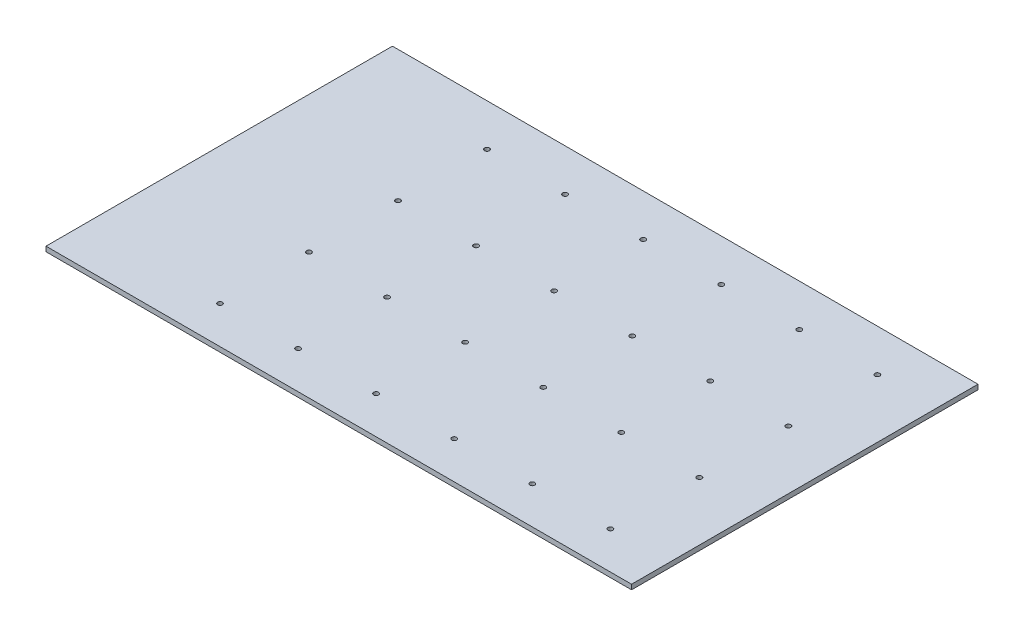
ISO-10303-21;
HEADER;
FILE_DESCRIPTION(('STEP AP214'),'2;1');
FILE_NAME('part.step','',(''),(''),'','','');
FILE_SCHEMA(('AUTOMOTIVE_DESIGN { 1 0 10303 214 1 1 1 1 }'));
ENDSEC;
DATA;
#1=APPLICATION_CONTEXT('core data for automotive mechanical design processes');
#2=APPLICATION_PROTOCOL_DEFINITION('international standard','automotive_design',2000,#1);
#3=PRODUCT_CONTEXT('',#1,'mechanical');
#4=PRODUCT('Part','Part','',(#3));
#5=PRODUCT_RELATED_PRODUCT_CATEGORY('part','',(#4));
#6=PRODUCT_DEFINITION_FORMATION('','',#4);
#7=PRODUCT_DEFINITION_CONTEXT('part definition',#1,'design');
#8=PRODUCT_DEFINITION('design','',#6,#7);
#9=PRODUCT_DEFINITION_SHAPE('','',#8);
#10=(LENGTH_UNIT() NAMED_UNIT(*) SI_UNIT(.MILLI.,.METRE.));
#11=(NAMED_UNIT(*) PLANE_ANGLE_UNIT() SI_UNIT($,.RADIAN.));
#12=(NAMED_UNIT(*) SI_UNIT($,.STERADIAN.) SOLID_ANGLE_UNIT());
#13=UNCERTAINTY_MEASURE_WITH_UNIT(LENGTH_MEASURE(1.E-05),#10,'distance_accuracy_value','');
#14=(GEOMETRIC_REPRESENTATION_CONTEXT(3) GLOBAL_UNCERTAINTY_ASSIGNED_CONTEXT((#13)) GLOBAL_UNIT_ASSIGNED_CONTEXT((#10,
#11,#12)) REPRESENTATION_CONTEXT('',''));
#15=CARTESIAN_POINT('',(0.,0.,0.));
#16=DIRECTION('',(0.,0.,1.));
#17=DIRECTION('',(1.,0.,0.));
#18=AXIS2_PLACEMENT_3D('',#15,#16,#17);
#19=CARTESIAN_POINT('',(0.,6.35,0.));
#20=DIRECTION('',(1.,0.,0.));
#21=DIRECTION('',(0.,0.,-1.));
#22=AXIS2_PLACEMENT_3D('',#19,#20,#21);
#23=PLANE('',#22);
#24=DIRECTION('',(0.,0.,1.));
#25=VECTOR('',#24,1.);
#26=CARTESIAN_POINT('',(0.,0.,0.));
#27=LINE('',#26,#25);
#28=CARTESIAN_POINT('',(0.,0.,-450.85));
#29=VERTEX_POINT('',#28);
#30=CARTESIAN_POINT('',(0.,0.,0.));
#31=VERTEX_POINT('',#30);
#32=EDGE_CURVE('E104',#29,#31,#27,.T.);
#33=ORIENTED_EDGE('',*,*,#32,.T.);
#34=DIRECTION('',(0.,-1.,0.));
#35=VECTOR('',#34,1.);
#36=CARTESIAN_POINT('',(0.,6.35,0.));
#37=LINE('',#36,#35);
#38=CARTESIAN_POINT('',(0.,6.35,0.));
#39=VERTEX_POINT('',#38);
#40=EDGE_CURVE('E11',#39,#31,#37,.T.);
#41=ORIENTED_EDGE('',*,*,#40,.F.);
#42=DIRECTION('',(0.,0.,1.));
#43=VECTOR('',#42,1.);
#44=CARTESIAN_POINT('',(0.,6.35,0.));
#45=LINE('',#44,#43);
#46=CARTESIAN_POINT('',(0.,6.35,-450.85));
#47=VERTEX_POINT('',#46);
#48=EDGE_CURVE('E92',#47,#39,#45,.T.);
#49=ORIENTED_EDGE('',*,*,#48,.F.);
#50=DIRECTION('',(0.,-1.,0.));
#51=VECTOR('',#50,1.);
#52=CARTESIAN_POINT('',(0.,6.35,-450.85));
#53=LINE('',#52,#51);
#54=EDGE_CURVE('E100',#47,#29,#53,.T.);
#55=ORIENTED_EDGE('',*,*,#54,.T.);
#56=EDGE_LOOP('',(#33,#41,#49,#55));
#57=FACE_BOUND('',#56,.T.);
#58=ADVANCED_FACE('F41',(#57),#23,.F.);
#59=CARTESIAN_POINT('',(0.,6.35,0.));
#60=DIRECTION('',(0.,0.,-1.));
#61=DIRECTION('',(-1.,0.,0.));
#62=AXIS2_PLACEMENT_3D('',#59,#60,#61);
#63=PLANE('',#62);
#64=DIRECTION('',(1.,0.,0.));
#65=VECTOR('',#64,1.);
#66=CARTESIAN_POINT('',(0.,0.,0.));
#67=LINE('',#66,#65);
#68=CARTESIAN_POINT('',(762.,0.,0.));
#69=VERTEX_POINT('',#68);
#70=EDGE_CURVE('E96',#31,#69,#67,.T.);
#71=ORIENTED_EDGE('',*,*,#70,.T.);
#72=DIRECTION('',(0.,-1.,0.));
#73=VECTOR('',#72,1.);
#74=CARTESIAN_POINT('',(762.,6.35,0.));
#75=LINE('',#74,#73);
#76=CARTESIAN_POINT('',(762.,6.35,0.));
#77=VERTEX_POINT('',#76);
#78=EDGE_CURVE('E49',#77,#69,#75,.T.);
#79=ORIENTED_EDGE('',*,*,#78,.F.);
#80=DIRECTION('',(1.,0.,0.));
#81=VECTOR('',#80,1.);
#82=CARTESIAN_POINT('',(0.,6.35,0.));
#83=LINE('',#82,#81);
#84=EDGE_CURVE('E87',#39,#77,#83,.T.);
#85=ORIENTED_EDGE('',*,*,#84,.F.);
#86=ORIENTED_EDGE('',*,*,#40,.T.);
#87=EDGE_LOOP('',(#71,#79,#85,#86));
#88=FACE_BOUND('',#87,.T.);
#89=ADVANCED_FACE('F95',(#88),#63,.F.);
#90=CARTESIAN_POINT('',(762.,6.35,0.));
#91=DIRECTION('',(-1.,0.,0.));
#92=DIRECTION('',(0.,0.,1.));
#93=AXIS2_PLACEMENT_3D('',#90,#91,#92);
#94=PLANE('',#93);
#95=DIRECTION('',(0.,0.,-1.));
#96=VECTOR('',#95,1.);
#97=CARTESIAN_POINT('',(762.,0.,0.));
#98=LINE('',#97,#96);
#99=CARTESIAN_POINT('',(762.,0.,-450.85));
#100=VERTEX_POINT('',#99);
#101=EDGE_CURVE('E74',#69,#100,#98,.T.);
#102=ORIENTED_EDGE('',*,*,#101,.T.);
#103=DIRECTION('',(0.,-1.,0.));
#104=VECTOR('',#103,1.);
#105=CARTESIAN_POINT('',(762.,6.35,-450.85));
#106=LINE('',#105,#104);
#107=CARTESIAN_POINT('',(762.,6.35,-450.85));
#108=VERTEX_POINT('',#107);
#109=EDGE_CURVE('E97',#108,#100,#106,.T.);
#110=ORIENTED_EDGE('',*,*,#109,.F.);
#111=DIRECTION('',(0.,0.,-1.));
#112=VECTOR('',#111,1.);
#113=CARTESIAN_POINT('',(762.,6.35,0.));
#114=LINE('',#113,#112);
#115=EDGE_CURVE('E90',#77,#108,#114,.T.);
#116=ORIENTED_EDGE('',*,*,#115,.F.);
#117=ORIENTED_EDGE('',*,*,#78,.T.);
#118=EDGE_LOOP('',(#102,#110,#116,#117));
#119=FACE_BOUND('',#118,.T.);
#120=ADVANCED_FACE('F98',(#119),#94,.F.);
#121=CARTESIAN_POINT('',(0.,6.35,-450.85));
#122=DIRECTION('',(0.,0.,1.));
#123=DIRECTION('',(1.,0.,0.));
#124=AXIS2_PLACEMENT_3D('',#121,#122,#123);
#125=PLANE('',#124);
#126=DIRECTION('',(-1.,0.,0.));
#127=VECTOR('',#126,1.);
#128=CARTESIAN_POINT('',(0.,0.,-450.85));
#129=LINE('',#128,#127);
#130=EDGE_CURVE('E80',#100,#29,#129,.T.);
#131=ORIENTED_EDGE('',*,*,#130,.T.);
#132=ORIENTED_EDGE('',*,*,#54,.F.);
#133=DIRECTION('',(-1.,0.,0.));
#134=VECTOR('',#133,1.);
#135=CARTESIAN_POINT('',(0.,6.35,-450.85));
#136=LINE('',#135,#134);
#137=EDGE_CURVE('E57',#108,#47,#136,.T.);
#138=ORIENTED_EDGE('',*,*,#137,.F.);
#139=ORIENTED_EDGE('',*,*,#109,.T.);
#140=EDGE_LOOP('',(#131,#132,#138,#139));
#141=FACE_BOUND('',#140,.T.);
#142=ADVANCED_FACE('F112',(#141),#125,.F.);
#143=CARTESIAN_POINT('',(0.,6.35,0.));
#144=DIRECTION('',(0.,-1.,0.));
#145=DIRECTION('',(0.,0.,-1.));
#146=AXIS2_PLACEMENT_3D('',#143,#144,#145);
#147=PLANE('',#146);
#148=CARTESIAN_POINT('',(177.8,6.35,-48.6156000000001));
#149=DIRECTION('',(0.,1.,0.));
#150=DIRECTION('',(0.,0.,1.));
#151=AXIS2_PLACEMENT_3D('',#148,#149,#150);
#152=CIRCLE('',#151,3.175);
#153=CARTESIAN_POINT('',(177.8,6.35,-45.4406000000001));
#154=VERTEX_POINT('',#153);
#155=EDGE_CURVE('E187',#154,#154,#152,.T.);
#156=ORIENTED_EDGE('',*,*,#155,.F.);
#157=EDGE_LOOP('',(#156));
#158=FACE_BOUND('',#157,.T.);
#159=CARTESIAN_POINT('',(482.6,6.35,-164.4396));
#160=DIRECTION('',(0.,1.,0.));
#161=DIRECTION('',(0.,0.,1.));
#162=AXIS2_PLACEMENT_3D('',#159,#160,#161);
#163=CIRCLE('',#162,3.17499999999986);
#164=CARTESIAN_POINT('',(482.6,6.35,-161.2646));
#165=VERTEX_POINT('',#164);
#166=EDGE_CURVE('E176',#165,#165,#163,.T.);
#167=ORIENTED_EDGE('',*,*,#166,.F.);
#168=EDGE_LOOP('',(#167));
#169=FACE_BOUND('',#168,.T.);
#170=CARTESIAN_POINT('',(381.,6.35,-164.4396));
#171=DIRECTION('',(0.,1.,0.));
#172=DIRECTION('',(0.,0.,1.));
#173=AXIS2_PLACEMENT_3D('',#170,#171,#172);
#174=CIRCLE('',#173,3.17499999999997);
#175=CARTESIAN_POINT('',(381.,6.35,-161.2646));
#176=VERTEX_POINT('',#175);
#177=EDGE_CURVE('E175',#176,#176,#174,.T.);
#178=ORIENTED_EDGE('',*,*,#177,.F.);
#179=EDGE_LOOP('',(#178));
#180=FACE_BOUND('',#179,.T.);
#181=CARTESIAN_POINT('',(279.4,6.35,-164.4396));
#182=DIRECTION('',(0.,1.,0.));
#183=DIRECTION('',(0.,0.,1.));
#184=AXIS2_PLACEMENT_3D('',#181,#182,#183);
#185=CIRCLE('',#184,3.17499999999997);
#186=CARTESIAN_POINT('',(279.4,6.35,-161.2646));
#187=VERTEX_POINT('',#186);
#188=EDGE_CURVE('E164',#187,#187,#185,.T.);
#189=ORIENTED_EDGE('',*,*,#188,.F.);
#190=EDGE_LOOP('',(#189));
#191=FACE_BOUND('',#190,.T.);
#192=CARTESIAN_POINT('',(279.4,6.35,-48.6156000000001));
#193=DIRECTION('',(0.,1.,0.));
#194=DIRECTION('',(0.,0.,1.));
#195=AXIS2_PLACEMENT_3D('',#192,#193,#194);
#196=CIRCLE('',#195,3.17499999999997);
#197=CARTESIAN_POINT('',(279.4,6.35,-45.4406000000001));
#198=VERTEX_POINT('',#197);
#199=EDGE_CURVE('E188',#198,#198,#196,.T.);
#200=ORIENTED_EDGE('',*,*,#199,.F.);
#201=EDGE_LOOP('',(#200));
#202=FACE_BOUND('',#201,.T.);
#203=CARTESIAN_POINT('',(381.,6.35,-48.6156000000001));
#204=DIRECTION('',(0.,1.,0.));
#205=DIRECTION('',(0.,0.,1.));
#206=AXIS2_PLACEMENT_3D('',#203,#204,#205);
#207=CIRCLE('',#206,3.17499999999997);
#208=CARTESIAN_POINT('',(381.,6.35,-45.4406000000001));
#209=VERTEX_POINT('',#208);
#210=EDGE_CURVE('E212',#209,#209,#207,.T.);
#211=ORIENTED_EDGE('',*,*,#210,.F.);
#212=EDGE_LOOP('',(#211));
#213=FACE_BOUND('',#212,.T.);
#214=CARTESIAN_POINT('',(482.6,6.35,-48.6156000000001));
#215=DIRECTION('',(0.,1.,0.));
#216=DIRECTION('',(0.,0.,1.));
#217=AXIS2_PLACEMENT_3D('',#214,#215,#216);
#218=CIRCLE('',#217,3.17499999999985);
#219=CARTESIAN_POINT('',(482.6,6.35,-45.4406000000002));
#220=VERTEX_POINT('',#219);
#221=EDGE_CURVE('E206',#220,#220,#218,.T.);
#222=ORIENTED_EDGE('',*,*,#221,.F.);
#223=EDGE_LOOP('',(#222));
#224=FACE_BOUND('',#223,.T.);
#225=CARTESIAN_POINT('',(584.2,6.35,-396.0876));
#226=DIRECTION('',(0.,1.,0.));
#227=DIRECTION('',(0.,0.,1.));
#228=AXIS2_PLACEMENT_3D('',#225,#226,#227);
#229=CIRCLE('',#228,3.17499999999985);
#230=CARTESIAN_POINT('',(584.2,6.35,-392.9126));
#231=VERTEX_POINT('',#230);
#232=EDGE_CURVE('E199',#231,#231,#229,.T.);
#233=ORIENTED_EDGE('',*,*,#232,.F.);
#234=EDGE_LOOP('',(#233));
#235=FACE_BOUND('',#234,.T.);
#236=CARTESIAN_POINT('',(177.8,6.35,-280.2636));
#237=DIRECTION('',(0.,1.,0.));
#238=DIRECTION('',(0.,0.,1.));
#239=AXIS2_PLACEMENT_3D('',#236,#237,#238);
#240=CIRCLE('',#239,3.17499999999997);
#241=CARTESIAN_POINT('',(177.8,6.35,-277.0886));
#242=VERTEX_POINT('',#241);
#243=EDGE_CURVE('E139',#242,#242,#240,.T.);
#244=ORIENTED_EDGE('',*,*,#243,.F.);
#245=EDGE_LOOP('',(#244));
#246=FACE_BOUND('',#245,.T.);
#247=CARTESIAN_POINT('',(482.6,6.35,-396.0876));
#248=DIRECTION('',(0.,1.,0.));
#249=DIRECTION('',(0.,0.,1.));
#250=AXIS2_PLACEMENT_3D('',#247,#248,#249);
#251=CIRCLE('',#250,3.17499999999985);
#252=CARTESIAN_POINT('',(482.6,6.35,-392.9126));
#253=VERTEX_POINT('',#252);
#254=EDGE_CURVE('E128',#253,#253,#251,.T.);
#255=ORIENTED_EDGE('',*,*,#254,.F.);
#256=EDGE_LOOP('',(#255));
#257=FACE_BOUND('',#256,.T.);
#258=CARTESIAN_POINT('',(381.,6.35,-396.0876));
#259=DIRECTION('',(0.,1.,0.));
#260=DIRECTION('',(0.,0.,1.));
#261=AXIS2_PLACEMENT_3D('',#258,#259,#260);
#262=CIRCLE('',#261,3.17499999999997);
#263=CARTESIAN_POINT('',(381.,6.35,-392.9126));
#264=VERTEX_POINT('',#263);
#265=EDGE_CURVE('E127',#264,#264,#262,.T.);
#266=ORIENTED_EDGE('',*,*,#265,.F.);
#267=EDGE_LOOP('',(#266));
#268=FACE_BOUND('',#267,.T.);
#269=CARTESIAN_POINT('',(279.4,6.35,-396.0876));
#270=DIRECTION('',(0.,1.,0.));
#271=DIRECTION('',(0.,0.,1.));
#272=AXIS2_PLACEMENT_3D('',#269,#270,#271);
#273=CIRCLE('',#272,3.17499999999997);
#274=CARTESIAN_POINT('',(279.4,6.35,-392.9126));
#275=VERTEX_POINT('',#274);
#276=EDGE_CURVE('E121',#275,#275,#273,.T.);
#277=ORIENTED_EDGE('',*,*,#276,.F.);
#278=EDGE_LOOP('',(#277));
#279=FACE_BOUND('',#278,.T.);
#280=CARTESIAN_POINT('',(177.8,6.35,-164.4396));
#281=DIRECTION('',(0.,1.,0.));
#282=DIRECTION('',(0.,0.,1.));
#283=AXIS2_PLACEMENT_3D('',#280,#281,#282);
#284=CIRCLE('',#283,3.175);
#285=CARTESIAN_POINT('',(177.8,6.35,-161.2646));
#286=VERTEX_POINT('',#285);
#287=EDGE_CURVE('E163',#286,#286,#284,.T.);
#288=ORIENTED_EDGE('',*,*,#287,.F.);
#289=EDGE_LOOP('',(#288));
#290=FACE_BOUND('',#289,.T.);
#291=CARTESIAN_POINT('',(482.6,6.35,-280.2636));
#292=DIRECTION('',(0.,1.,0.));
#293=DIRECTION('',(0.,0.,1.));
#294=AXIS2_PLACEMENT_3D('',#291,#292,#293);
#295=CIRCLE('',#294,3.17499999999985);
#296=CARTESIAN_POINT('',(482.6,6.35,-277.0886));
#297=VERTEX_POINT('',#296);
#298=EDGE_CURVE('E152',#297,#297,#295,.T.);
#299=ORIENTED_EDGE('',*,*,#298,.F.);
#300=EDGE_LOOP('',(#299));
#301=FACE_BOUND('',#300,.T.);
#302=CARTESIAN_POINT('',(381.,6.35,-280.2636));
#303=DIRECTION('',(0.,1.,0.));
#304=DIRECTION('',(0.,0.,1.));
#305=AXIS2_PLACEMENT_3D('',#302,#303,#304);
#306=CIRCLE('',#305,3.17499999999997);
#307=CARTESIAN_POINT('',(381.,6.35,-277.0886));
#308=VERTEX_POINT('',#307);
#309=EDGE_CURVE('E151',#308,#308,#306,.T.);
#310=ORIENTED_EDGE('',*,*,#309,.F.);
#311=EDGE_LOOP('',(#310));
#312=FACE_BOUND('',#311,.T.);
#313=CARTESIAN_POINT('',(279.4,6.35,-280.2636));
#314=DIRECTION('',(0.,1.,0.));
#315=DIRECTION('',(0.,0.,1.));
#316=AXIS2_PLACEMENT_3D('',#313,#314,#315);
#317=CIRCLE('',#316,3.17499999999997);
#318=CARTESIAN_POINT('',(279.4,6.35,-277.0886));
#319=VERTEX_POINT('',#318);
#320=EDGE_CURVE('E140',#319,#319,#317,.T.);
#321=ORIENTED_EDGE('',*,*,#320,.F.);
#322=EDGE_LOOP('',(#321));
#323=FACE_BOUND('',#322,.T.);
#324=CARTESIAN_POINT('',(685.8,6.35,-164.4396));
#325=DIRECTION('',(0.,1.,0.));
#326=DIRECTION('',(0.,0.,1.));
#327=AXIS2_PLACEMENT_3D('',#324,#325,#326);
#328=CIRCLE('',#327,3.17499999999985);
#329=CARTESIAN_POINT('',(685.8,6.35,-161.2646));
#330=VERTEX_POINT('',#329);
#331=EDGE_CURVE('E236',#330,#330,#328,.T.);
#332=ORIENTED_EDGE('',*,*,#331,.F.);
#333=EDGE_LOOP('',(#332));
#334=FACE_BOUND('',#333,.T.);
#335=CARTESIAN_POINT('',(584.2,6.35,-48.6156000000001));
#336=DIRECTION('',(0.,1.,0.));
#337=DIRECTION('',(0.,0.,1.));
#338=AXIS2_PLACEMENT_3D('',#335,#336,#337);
#339=CIRCLE('',#338,3.17499999999985);
#340=CARTESIAN_POINT('',(584.2,6.35,-45.4406000000002));
#341=VERTEX_POINT('',#340);
#342=EDGE_CURVE('E247',#341,#341,#339,.T.);
#343=ORIENTED_EDGE('',*,*,#342,.F.);
#344=EDGE_LOOP('',(#343));
#345=FACE_BOUND('',#344,.T.);
#346=CARTESIAN_POINT('',(685.8,6.35,-48.6156000000001));
#347=DIRECTION('',(0.,1.,0.));
#348=DIRECTION('',(0.,0.,1.));
#349=AXIS2_PLACEMENT_3D('',#346,#347,#348);
#350=CIRCLE('',#349,3.17499999999985);
#351=CARTESIAN_POINT('',(685.8,6.35,-45.4406000000002));
#352=VERTEX_POINT('',#351);
#353=EDGE_CURVE('E248',#352,#352,#350,.T.);
#354=ORIENTED_EDGE('',*,*,#353,.F.);
#355=EDGE_LOOP('',(#354));
#356=FACE_BOUND('',#355,.T.);
#357=CARTESIAN_POINT('',(685.8,6.35,-396.0876));
#358=DIRECTION('',(0.,1.,0.));
#359=DIRECTION('',(0.,0.,1.));
#360=AXIS2_PLACEMENT_3D('',#357,#358,#359);
#361=CIRCLE('',#360,3.17499999999985);
#362=CARTESIAN_POINT('',(685.8,6.35,-392.9126));
#363=VERTEX_POINT('',#362);
#364=EDGE_CURVE('E200',#363,#363,#361,.T.);
#365=ORIENTED_EDGE('',*,*,#364,.F.);
#366=EDGE_LOOP('',(#365));
#367=FACE_BOUND('',#366,.T.);
#368=CARTESIAN_POINT('',(584.2,6.35,-280.2636));
#369=DIRECTION('',(0.,1.,0.));
#370=DIRECTION('',(0.,0.,1.));
#371=AXIS2_PLACEMENT_3D('',#368,#369,#370);
#372=CIRCLE('',#371,3.17499999999985);
#373=CARTESIAN_POINT('',(584.2,6.35,-277.0886));
#374=VERTEX_POINT('',#373);
#375=EDGE_CURVE('E223',#374,#374,#372,.T.);
#376=ORIENTED_EDGE('',*,*,#375,.F.);
#377=EDGE_LOOP('',(#376));
#378=FACE_BOUND('',#377,.T.);
#379=CARTESIAN_POINT('',(685.8,6.35,-280.2636));
#380=DIRECTION('',(0.,1.,0.));
#381=DIRECTION('',(0.,0.,1.));
#382=AXIS2_PLACEMENT_3D('',#379,#380,#381);
#383=CIRCLE('',#382,3.17499999999985);
#384=CARTESIAN_POINT('',(685.8,6.35,-277.0886));
#385=VERTEX_POINT('',#384);
#386=EDGE_CURVE('E224',#385,#385,#383,.T.);
#387=ORIENTED_EDGE('',*,*,#386,.F.);
#388=EDGE_LOOP('',(#387));
#389=FACE_BOUND('',#388,.T.);
#390=CARTESIAN_POINT('',(584.2,6.35,-164.4396));
#391=DIRECTION('',(0.,1.,0.));
#392=DIRECTION('',(0.,0.,1.));
#393=AXIS2_PLACEMENT_3D('',#390,#391,#392);
#394=CIRCLE('',#393,3.17499999999985);
#395=CARTESIAN_POINT('',(584.2,6.35,-161.2646));
#396=VERTEX_POINT('',#395);
#397=EDGE_CURVE('E235',#396,#396,#394,.T.);
#398=ORIENTED_EDGE('',*,*,#397,.F.);
#399=EDGE_LOOP('',(#398));
#400=FACE_BOUND('',#399,.T.);
#401=CARTESIAN_POINT('',(177.8,6.35,-396.0876));
#402=DIRECTION('',(0.,1.,0.));
#403=DIRECTION('',(0.,0.,1.));
#404=AXIS2_PLACEMENT_3D('',#401,#402,#403);
#405=CIRCLE('',#404,3.175);
#406=CARTESIAN_POINT('',(177.8,6.35,-392.9126));
#407=VERTEX_POINT('',#406);
#408=EDGE_CURVE('E118',#407,#407,#405,.T.);
#409=ORIENTED_EDGE('',*,*,#408,.F.);
#410=EDGE_LOOP('',(#409));
#411=FACE_BOUND('',#410,.T.);
#412=ORIENTED_EDGE('',*,*,#48,.T.);
#413=ORIENTED_EDGE('',*,*,#84,.T.);
#414=ORIENTED_EDGE('',*,*,#115,.T.);
#415=ORIENTED_EDGE('',*,*,#137,.T.);
#416=EDGE_LOOP('',(#412,#413,#414,#415));
#417=FACE_BOUND('',#416,.T.);
#418=ADVANCED_FACE('F88',(#158,#169,#180,#191,#202,#213,#224,#235,#246,#257,#268,#279,#290,#301,
#312,#323,#334,#345,#356,#367,#378,#389,#400,#411,#417),#147,.F.);
#419=CARTESIAN_POINT('',(0.,0.,0.));
#420=DIRECTION('',(0.,-1.,0.));
#421=DIRECTION('',(0.,0.,-1.));
#422=AXIS2_PLACEMENT_3D('',#419,#420,#421);
#423=PLANE('',#422);
#424=CARTESIAN_POINT('',(177.8,0.,-48.6156000000001));
#425=DIRECTION('',(0.,1.,0.));
#426=DIRECTION('',(0.,0.,1.));
#427=AXIS2_PLACEMENT_3D('',#424,#425,#426);
#428=CIRCLE('',#427,3.175);
#429=CARTESIAN_POINT('',(177.8,0.,-45.4406000000001));
#430=VERTEX_POINT('',#429);
#431=EDGE_CURVE('E184',#430,#430,#428,.T.);
#432=ORIENTED_EDGE('',*,*,#431,.T.);
#433=EDGE_LOOP('',(#432));
#434=FACE_BOUND('',#433,.T.);
#435=CARTESIAN_POINT('',(482.6,0.,-164.4396));
#436=DIRECTION('',(0.,1.,0.));
#437=DIRECTION('',(0.,0.,1.));
#438=AXIS2_PLACEMENT_3D('',#435,#436,#437);
#439=CIRCLE('',#438,3.17499999999986);
#440=CARTESIAN_POINT('',(482.6,0.,-161.2646));
#441=VERTEX_POINT('',#440);
#442=EDGE_CURVE('E191',#441,#441,#439,.T.);
#443=ORIENTED_EDGE('',*,*,#442,.T.);
#444=EDGE_LOOP('',(#443));
#445=FACE_BOUND('',#444,.T.);
#446=CARTESIAN_POINT('',(381.,0.,-164.4396));
#447=DIRECTION('',(0.,1.,0.));
#448=DIRECTION('',(0.,0.,1.));
#449=AXIS2_PLACEMENT_3D('',#446,#447,#448);
#450=CIRCLE('',#449,3.17499999999997);
#451=CARTESIAN_POINT('',(381.,0.,-161.2646));
#452=VERTEX_POINT('',#451);
#453=EDGE_CURVE('E172',#452,#452,#450,.T.);
#454=ORIENTED_EDGE('',*,*,#453,.T.);
#455=EDGE_LOOP('',(#454));
#456=FACE_BOUND('',#455,.T.);
#457=CARTESIAN_POINT('',(279.4,0.,-164.4396));
#458=DIRECTION('',(0.,1.,0.));
#459=DIRECTION('',(0.,0.,1.));
#460=AXIS2_PLACEMENT_3D('',#457,#458,#459);
#461=CIRCLE('',#460,3.17499999999997);
#462=CARTESIAN_POINT('',(279.4,0.,-161.2646));
#463=VERTEX_POINT('',#462);
#464=EDGE_CURVE('E179',#463,#463,#461,.T.);
#465=ORIENTED_EDGE('',*,*,#464,.T.);
#466=EDGE_LOOP('',(#465));
#467=FACE_BOUND('',#466,.T.);
#468=CARTESIAN_POINT('',(279.4,0.,-48.6156000000001));
#469=DIRECTION('',(0.,1.,0.));
#470=DIRECTION('',(0.,0.,1.));
#471=AXIS2_PLACEMENT_3D('',#468,#469,#470);
#472=CIRCLE('',#471,3.17499999999997);
#473=CARTESIAN_POINT('',(279.4,0.,-45.4406000000001));
#474=VERTEX_POINT('',#473);
#475=EDGE_CURVE('E215',#474,#474,#472,.T.);
#476=ORIENTED_EDGE('',*,*,#475,.T.);
#477=EDGE_LOOP('',(#476));
#478=FACE_BOUND('',#477,.T.);
#479=CARTESIAN_POINT('',(381.,0.,-48.6156000000001));
#480=DIRECTION('',(0.,1.,0.));
#481=DIRECTION('',(0.,0.,1.));
#482=AXIS2_PLACEMENT_3D('',#479,#480,#481);
#483=CIRCLE('',#482,3.17499999999997);
#484=CARTESIAN_POINT('',(381.,0.,-45.4406000000001));
#485=VERTEX_POINT('',#484);
#486=EDGE_CURVE('E209',#485,#485,#483,.T.);
#487=ORIENTED_EDGE('',*,*,#486,.T.);
#488=EDGE_LOOP('',(#487));
#489=FACE_BOUND('',#488,.T.);
#490=CARTESIAN_POINT('',(482.6,0.,-48.6156000000001));
#491=DIRECTION('',(0.,1.,0.));
#492=DIRECTION('',(0.,0.,1.));
#493=AXIS2_PLACEMENT_3D('',#490,#491,#492);
#494=CIRCLE('',#493,3.17499999999985);
#495=CARTESIAN_POINT('',(482.6,0.,-45.4406000000002));
#496=VERTEX_POINT('',#495);
#497=EDGE_CURVE('E203',#496,#496,#494,.T.);
#498=ORIENTED_EDGE('',*,*,#497,.T.);
#499=EDGE_LOOP('',(#498));
#500=FACE_BOUND('',#499,.T.);
#501=CARTESIAN_POINT('',(584.2,0.,-396.0876));
#502=DIRECTION('',(0.,1.,0.));
#503=DIRECTION('',(0.,0.,1.));
#504=AXIS2_PLACEMENT_3D('',#501,#502,#503);
#505=CIRCLE('',#504,3.17499999999985);
#506=CARTESIAN_POINT('',(584.2,0.,-392.9126));
#507=VERTEX_POINT('',#506);
#508=EDGE_CURVE('E196',#507,#507,#505,.T.);
#509=ORIENTED_EDGE('',*,*,#508,.T.);
#510=EDGE_LOOP('',(#509));
#511=FACE_BOUND('',#510,.T.);
#512=CARTESIAN_POINT('',(177.8,0.,-280.2636));
#513=DIRECTION('',(0.,1.,0.));
#514=DIRECTION('',(0.,0.,1.));
#515=AXIS2_PLACEMENT_3D('',#512,#513,#514);
#516=CIRCLE('',#515,3.17499999999997);
#517=CARTESIAN_POINT('',(177.8,0.,-277.0886));
#518=VERTEX_POINT('',#517);
#519=EDGE_CURVE('E136',#518,#518,#516,.T.);
#520=ORIENTED_EDGE('',*,*,#519,.T.);
#521=EDGE_LOOP('',(#520));
#522=FACE_BOUND('',#521,.T.);
#523=CARTESIAN_POINT('',(482.6,0.,-396.0876));
#524=DIRECTION('',(0.,1.,0.));
#525=DIRECTION('',(0.,0.,1.));
#526=AXIS2_PLACEMENT_3D('',#523,#524,#525);
#527=CIRCLE('',#526,3.17499999999985);
#528=CARTESIAN_POINT('',(482.6,0.,-392.9126));
#529=VERTEX_POINT('',#528);
#530=EDGE_CURVE('E143',#529,#529,#527,.T.);
#531=ORIENTED_EDGE('',*,*,#530,.T.);
#532=EDGE_LOOP('',(#531));
#533=FACE_BOUND('',#532,.T.);
#534=CARTESIAN_POINT('',(381.,0.,-396.0876));
#535=DIRECTION('',(0.,1.,0.));
#536=DIRECTION('',(0.,0.,1.));
#537=AXIS2_PLACEMENT_3D('',#534,#535,#536);
#538=CIRCLE('',#537,3.17499999999997);
#539=CARTESIAN_POINT('',(381.,0.,-392.9126));
#540=VERTEX_POINT('',#539);
#541=EDGE_CURVE('E124',#540,#540,#538,.T.);
#542=ORIENTED_EDGE('',*,*,#541,.T.);
#543=EDGE_LOOP('',(#542));
#544=FACE_BOUND('',#543,.T.);
#545=CARTESIAN_POINT('',(279.4,0.,-396.0876));
#546=DIRECTION('',(0.,1.,0.));
#547=DIRECTION('',(0.,0.,1.));
#548=AXIS2_PLACEMENT_3D('',#545,#546,#547);
#549=CIRCLE('',#548,3.17499999999997);
#550=CARTESIAN_POINT('',(279.4,0.,-392.9126));
#551=VERTEX_POINT('',#550);
#552=EDGE_CURVE('E131',#551,#551,#549,.T.);
#553=ORIENTED_EDGE('',*,*,#552,.T.);
#554=EDGE_LOOP('',(#553));
#555=FACE_BOUND('',#554,.T.);
#556=CARTESIAN_POINT('',(177.8,0.,-164.4396));
#557=DIRECTION('',(0.,1.,0.));
#558=DIRECTION('',(0.,0.,1.));
#559=AXIS2_PLACEMENT_3D('',#556,#557,#558);
#560=CIRCLE('',#559,3.175);
#561=CARTESIAN_POINT('',(177.8,0.,-161.2646));
#562=VERTEX_POINT('',#561);
#563=EDGE_CURVE('E160',#562,#562,#560,.T.);
#564=ORIENTED_EDGE('',*,*,#563,.T.);
#565=EDGE_LOOP('',(#564));
#566=FACE_BOUND('',#565,.T.);
#567=CARTESIAN_POINT('',(482.6,0.,-280.2636));
#568=DIRECTION('',(0.,1.,0.));
#569=DIRECTION('',(0.,0.,1.));
#570=AXIS2_PLACEMENT_3D('',#567,#568,#569);
#571=CIRCLE('',#570,3.17499999999985);
#572=CARTESIAN_POINT('',(482.6,0.,-277.0886));
#573=VERTEX_POINT('',#572);
#574=EDGE_CURVE('E167',#573,#573,#571,.T.);
#575=ORIENTED_EDGE('',*,*,#574,.T.);
#576=EDGE_LOOP('',(#575));
#577=FACE_BOUND('',#576,.T.);
#578=CARTESIAN_POINT('',(381.,0.,-280.2636));
#579=DIRECTION('',(0.,1.,0.));
#580=DIRECTION('',(0.,0.,1.));
#581=AXIS2_PLACEMENT_3D('',#578,#579,#580);
#582=CIRCLE('',#581,3.17499999999997);
#583=CARTESIAN_POINT('',(381.,0.,-277.0886));
#584=VERTEX_POINT('',#583);
#585=EDGE_CURVE('E148',#584,#584,#582,.T.);
#586=ORIENTED_EDGE('',*,*,#585,.T.);
#587=EDGE_LOOP('',(#586));
#588=FACE_BOUND('',#587,.T.);
#589=CARTESIAN_POINT('',(279.4,0.,-280.2636));
#590=DIRECTION('',(0.,1.,0.));
#591=DIRECTION('',(0.,0.,1.));
#592=AXIS2_PLACEMENT_3D('',#589,#590,#591);
#593=CIRCLE('',#592,3.17499999999997);
#594=CARTESIAN_POINT('',(279.4,0.,-277.0886));
#595=VERTEX_POINT('',#594);
#596=EDGE_CURVE('E155',#595,#595,#593,.T.);
#597=ORIENTED_EDGE('',*,*,#596,.T.);
#598=EDGE_LOOP('',(#597));
#599=FACE_BOUND('',#598,.T.);
#600=CARTESIAN_POINT('',(685.8,0.,-164.4396));
#601=DIRECTION('',(0.,1.,0.));
#602=DIRECTION('',(0.,0.,1.));
#603=AXIS2_PLACEMENT_3D('',#600,#601,#602);
#604=CIRCLE('',#603,3.17499999999985);
#605=CARTESIAN_POINT('',(685.8,0.,-161.2646));
#606=VERTEX_POINT('',#605);
#607=EDGE_CURVE('E251',#606,#606,#604,.T.);
#608=ORIENTED_EDGE('',*,*,#607,.T.);
#609=EDGE_LOOP('',(#608));
#610=FACE_BOUND('',#609,.T.);
#611=CARTESIAN_POINT('',(584.2,0.,-48.6156000000001));
#612=DIRECTION('',(0.,1.,0.));
#613=DIRECTION('',(0.,0.,1.));
#614=AXIS2_PLACEMENT_3D('',#611,#612,#613);
#615=CIRCLE('',#614,3.17499999999985);
#616=CARTESIAN_POINT('',(584.2,0.,-45.4406000000002));
#617=VERTEX_POINT('',#616);
#618=EDGE_CURVE('E244',#617,#617,#615,.T.);
#619=ORIENTED_EDGE('',*,*,#618,.T.);
#620=EDGE_LOOP('',(#619));
#621=FACE_BOUND('',#620,.T.);
#622=CARTESIAN_POINT('',(685.8,0.,-48.6156000000001));
#623=DIRECTION('',(0.,1.,0.));
#624=DIRECTION('',(0.,0.,1.));
#625=AXIS2_PLACEMENT_3D('',#622,#623,#624);
#626=CIRCLE('',#625,3.17499999999985);
#627=CARTESIAN_POINT('',(685.8,0.,-45.4406000000002));
#628=VERTEX_POINT('',#627);
#629=EDGE_CURVE('E256',#628,#628,#626,.T.);
#630=ORIENTED_EDGE('',*,*,#629,.T.);
#631=EDGE_LOOP('',(#630));
#632=FACE_BOUND('',#631,.T.);
#633=CARTESIAN_POINT('',(685.8,0.,-396.0876));
#634=DIRECTION('',(0.,1.,0.));
#635=DIRECTION('',(0.,0.,1.));
#636=AXIS2_PLACEMENT_3D('',#633,#634,#635);
#637=CIRCLE('',#636,3.17499999999985);
#638=CARTESIAN_POINT('',(685.8,0.,-392.9126));
#639=VERTEX_POINT('',#638);
#640=EDGE_CURVE('E227',#639,#639,#637,.T.);
#641=ORIENTED_EDGE('',*,*,#640,.T.);
#642=EDGE_LOOP('',(#641));
#643=FACE_BOUND('',#642,.T.);
#644=CARTESIAN_POINT('',(584.2,0.,-280.2636));
#645=DIRECTION('',(0.,1.,0.));
#646=DIRECTION('',(0.,0.,1.));
#647=AXIS2_PLACEMENT_3D('',#644,#645,#646);
#648=CIRCLE('',#647,3.17499999999985);
#649=CARTESIAN_POINT('',(584.2,0.,-277.0886));
#650=VERTEX_POINT('',#649);
#651=EDGE_CURVE('E220',#650,#650,#648,.T.);
#652=ORIENTED_EDGE('',*,*,#651,.T.);
#653=EDGE_LOOP('',(#652));
#654=FACE_BOUND('',#653,.T.);
#655=CARTESIAN_POINT('',(685.8,0.,-280.2636));
#656=DIRECTION('',(0.,1.,0.));
#657=DIRECTION('',(0.,0.,1.));
#658=AXIS2_PLACEMENT_3D('',#655,#656,#657);
#659=CIRCLE('',#658,3.17499999999985);
#660=CARTESIAN_POINT('',(685.8,0.,-277.0886));
#661=VERTEX_POINT('',#660);
#662=EDGE_CURVE('E239',#661,#661,#659,.T.);
#663=ORIENTED_EDGE('',*,*,#662,.T.);
#664=EDGE_LOOP('',(#663));
#665=FACE_BOUND('',#664,.T.);
#666=CARTESIAN_POINT('',(584.2,0.,-164.4396));
#667=DIRECTION('',(0.,1.,0.));
#668=DIRECTION('',(0.,0.,1.));
#669=AXIS2_PLACEMENT_3D('',#666,#667,#668);
#670=CIRCLE('',#669,3.17499999999985);
#671=CARTESIAN_POINT('',(584.2,0.,-161.2646));
#672=VERTEX_POINT('',#671);
#673=EDGE_CURVE('E232',#672,#672,#670,.T.);
#674=ORIENTED_EDGE('',*,*,#673,.T.);
#675=EDGE_LOOP('',(#674));
#676=FACE_BOUND('',#675,.T.);
#677=CARTESIAN_POINT('',(177.8,0.,-396.0876));
#678=DIRECTION('',(0.,1.,0.));
#679=DIRECTION('',(0.,0.,1.));
#680=AXIS2_PLACEMENT_3D('',#677,#678,#679);
#681=CIRCLE('',#680,3.175);
#682=CARTESIAN_POINT('',(177.8,0.,-392.9126));
#683=VERTEX_POINT('',#682);
#684=EDGE_CURVE('E107',#683,#683,#681,.T.);
#685=ORIENTED_EDGE('',*,*,#684,.T.);
#686=EDGE_LOOP('',(#685));
#687=FACE_BOUND('',#686,.T.);
#688=ORIENTED_EDGE('',*,*,#32,.F.);
#689=ORIENTED_EDGE('',*,*,#130,.F.);
#690=ORIENTED_EDGE('',*,*,#101,.F.);
#691=ORIENTED_EDGE('',*,*,#70,.F.);
#692=EDGE_LOOP('',(#688,#689,#690,#691));
#693=FACE_BOUND('',#692,.T.);
#694=ADVANCED_FACE('F115',(#434,#445,#456,#467,#478,#489,#500,#511,#522,#533,#544,#555,#566,
#577,#588,#599,#610,#621,#632,#643,#654,#665,#676,#687,#693),#423,.T.);
#695=CARTESIAN_POINT('',(177.8,0.,-396.0876));
#696=DIRECTION('',(0.,1.,0.));
#697=DIRECTION('',(0.,0.,1.));
#698=AXIS2_PLACEMENT_3D('',#695,#696,#697);
#699=CYLINDRICAL_SURFACE('',#698,3.175);
#700=ORIENTED_EDGE('',*,*,#684,.F.);
#701=EDGE_LOOP('',(#700));
#702=FACE_BOUND('',#701,.T.);
#703=ORIENTED_EDGE('',*,*,#408,.T.);
#704=EDGE_LOOP('',(#703));
#705=FACE_BOUND('',#704,.T.);
#706=ADVANCED_FACE('F278',(#702,#705),#699,.F.);
#707=CARTESIAN_POINT('',(584.2,0.,-164.4396));
#708=DIRECTION('',(0.,1.,0.));
#709=DIRECTION('',(0.,0.,1.));
#710=AXIS2_PLACEMENT_3D('',#707,#708,#709);
#711=CYLINDRICAL_SURFACE('',#710,3.17499999999985);
#712=ORIENTED_EDGE('',*,*,#673,.F.);
#713=EDGE_LOOP('',(#712));
#714=FACE_BOUND('',#713,.T.);
#715=ORIENTED_EDGE('',*,*,#397,.T.);
#716=EDGE_LOOP('',(#715));
#717=FACE_BOUND('',#716,.T.);
#718=ADVANCED_FACE('F280',(#714,#717),#711,.F.);
#719=CARTESIAN_POINT('',(685.8,0.,-280.2636));
#720=DIRECTION('',(0.,1.,0.));
#721=DIRECTION('',(0.,0.,1.));
#722=AXIS2_PLACEMENT_3D('',#719,#720,#721);
#723=CYLINDRICAL_SURFACE('',#722,3.17499999999985);
#724=ORIENTED_EDGE('',*,*,#662,.F.);
#725=EDGE_LOOP('',(#724));
#726=FACE_BOUND('',#725,.T.);
#727=ORIENTED_EDGE('',*,*,#386,.T.);
#728=EDGE_LOOP('',(#727));
#729=FACE_BOUND('',#728,.T.);
#730=ADVANCED_FACE('F287',(#726,#729),#723,.F.);
#731=CARTESIAN_POINT('',(584.2,0.,-280.2636));
#732=DIRECTION('',(0.,1.,0.));
#733=DIRECTION('',(0.,0.,1.));
#734=AXIS2_PLACEMENT_3D('',#731,#732,#733);
#735=CYLINDRICAL_SURFACE('',#734,3.17499999999985);
#736=ORIENTED_EDGE('',*,*,#651,.F.);
#737=EDGE_LOOP('',(#736));
#738=FACE_BOUND('',#737,.T.);
#739=ORIENTED_EDGE('',*,*,#375,.T.);
#740=EDGE_LOOP('',(#739));
#741=FACE_BOUND('',#740,.T.);
#742=ADVANCED_FACE('F335',(#738,#741),#735,.F.);
#743=CARTESIAN_POINT('',(685.8,0.,-396.0876));
#744=DIRECTION('',(0.,1.,0.));
#745=DIRECTION('',(0.,0.,1.));
#746=AXIS2_PLACEMENT_3D('',#743,#744,#745);
#747=CYLINDRICAL_SURFACE('',#746,3.17499999999985);
#748=ORIENTED_EDGE('',*,*,#640,.F.);
#749=EDGE_LOOP('',(#748));
#750=FACE_BOUND('',#749,.T.);
#751=ORIENTED_EDGE('',*,*,#364,.T.);
#752=EDGE_LOOP('',(#751));
#753=FACE_BOUND('',#752,.T.);
#754=ADVANCED_FACE('F345',(#750,#753),#747,.F.);
#755=CARTESIAN_POINT('',(685.8,0.,-48.6156000000001));
#756=DIRECTION('',(0.,1.,0.));
#757=DIRECTION('',(0.,0.,1.));
#758=AXIS2_PLACEMENT_3D('',#755,#756,#757);
#759=CYLINDRICAL_SURFACE('',#758,3.17499999999985);
#760=ORIENTED_EDGE('',*,*,#629,.F.);
#761=EDGE_LOOP('',(#760));
#762=FACE_BOUND('',#761,.T.);
#763=ORIENTED_EDGE('',*,*,#353,.T.);
#764=EDGE_LOOP('',(#763));
#765=FACE_BOUND('',#764,.T.);
#766=ADVANCED_FACE('F262',(#762,#765),#759,.F.);
#767=CARTESIAN_POINT('',(584.2,0.,-48.6156000000001));
#768=DIRECTION('',(0.,1.,0.));
#769=DIRECTION('',(0.,0.,1.));
#770=AXIS2_PLACEMENT_3D('',#767,#768,#769);
#771=CYLINDRICAL_SURFACE('',#770,3.17499999999985);
#772=ORIENTED_EDGE('',*,*,#618,.F.);
#773=EDGE_LOOP('',(#772));
#774=FACE_BOUND('',#773,.T.);
#775=ORIENTED_EDGE('',*,*,#342,.T.);
#776=EDGE_LOOP('',(#775));
#777=FACE_BOUND('',#776,.T.);
#778=ADVANCED_FACE('F364',(#774,#777),#771,.F.);
#779=CARTESIAN_POINT('',(685.8,0.,-164.4396));
#780=DIRECTION('',(0.,1.,0.));
#781=DIRECTION('',(0.,0.,1.));
#782=AXIS2_PLACEMENT_3D('',#779,#780,#781);
#783=CYLINDRICAL_SURFACE('',#782,3.17499999999985);
#784=ORIENTED_EDGE('',*,*,#607,.F.);
#785=EDGE_LOOP('',(#784));
#786=FACE_BOUND('',#785,.T.);
#787=ORIENTED_EDGE('',*,*,#331,.T.);
#788=EDGE_LOOP('',(#787));
#789=FACE_BOUND('',#788,.T.);
#790=ADVANCED_FACE('F374',(#786,#789),#783,.F.);
#791=CARTESIAN_POINT('',(279.4,0.,-280.2636));
#792=DIRECTION('',(0.,1.,0.));
#793=DIRECTION('',(0.,0.,1.));
#794=AXIS2_PLACEMENT_3D('',#791,#792,#793);
#795=CYLINDRICAL_SURFACE('',#794,3.17499999999997);
#796=ORIENTED_EDGE('',*,*,#596,.F.);
#797=EDGE_LOOP('',(#796));
#798=FACE_BOUND('',#797,.T.);
#799=ORIENTED_EDGE('',*,*,#320,.T.);
#800=EDGE_LOOP('',(#799));
#801=FACE_BOUND('',#800,.T.);
#802=ADVANCED_FACE('F384',(#798,#801),#795,.F.);
#803=CARTESIAN_POINT('',(381.,0.,-280.2636));
#804=DIRECTION('',(0.,1.,0.));
#805=DIRECTION('',(0.,0.,1.));
#806=AXIS2_PLACEMENT_3D('',#803,#804,#805);
#807=CYLINDRICAL_SURFACE('',#806,3.17499999999997);
#808=ORIENTED_EDGE('',*,*,#585,.F.);
#809=EDGE_LOOP('',(#808));
#810=FACE_BOUND('',#809,.T.);
#811=ORIENTED_EDGE('',*,*,#309,.T.);
#812=EDGE_LOOP('',(#811));
#813=FACE_BOUND('',#812,.T.);
#814=ADVANCED_FACE('F394',(#810,#813),#807,.F.);
#815=CARTESIAN_POINT('',(482.6,0.,-280.2636));
#816=DIRECTION('',(0.,1.,0.));
#817=DIRECTION('',(0.,0.,1.));
#818=AXIS2_PLACEMENT_3D('',#815,#816,#817);
#819=CYLINDRICAL_SURFACE('',#818,3.17499999999985);
#820=ORIENTED_EDGE('',*,*,#574,.F.);
#821=EDGE_LOOP('',(#820));
#822=FACE_BOUND('',#821,.T.);
#823=ORIENTED_EDGE('',*,*,#298,.T.);
#824=EDGE_LOOP('',(#823));
#825=FACE_BOUND('',#824,.T.);
#826=ADVANCED_FACE('F404',(#822,#825),#819,.F.);
#827=CARTESIAN_POINT('',(177.8,0.,-164.4396));
#828=DIRECTION('',(0.,1.,0.));
#829=DIRECTION('',(0.,0.,1.));
#830=AXIS2_PLACEMENT_3D('',#827,#828,#829);
#831=CYLINDRICAL_SURFACE('',#830,3.175);
#832=ORIENTED_EDGE('',*,*,#563,.F.);
#833=EDGE_LOOP('',(#832));
#834=FACE_BOUND('',#833,.T.);
#835=ORIENTED_EDGE('',*,*,#287,.T.);
#836=EDGE_LOOP('',(#835));
#837=FACE_BOUND('',#836,.T.);
#838=ADVANCED_FACE('F414',(#834,#837),#831,.F.);
#839=CARTESIAN_POINT('',(279.4,0.,-396.0876));
#840=DIRECTION('',(0.,1.,0.));
#841=DIRECTION('',(0.,0.,1.));
#842=AXIS2_PLACEMENT_3D('',#839,#840,#841);
#843=CYLINDRICAL_SURFACE('',#842,3.17499999999997);
#844=ORIENTED_EDGE('',*,*,#552,.F.);
#845=EDGE_LOOP('',(#844));
#846=FACE_BOUND('',#845,.T.);
#847=ORIENTED_EDGE('',*,*,#276,.T.);
#848=EDGE_LOOP('',(#847));
#849=FACE_BOUND('',#848,.T.);
#850=ADVANCED_FACE('F424',(#846,#849),#843,.F.);
#851=CARTESIAN_POINT('',(381.,0.,-396.0876));
#852=DIRECTION('',(0.,1.,0.));
#853=DIRECTION('',(0.,0.,1.));
#854=AXIS2_PLACEMENT_3D('',#851,#852,#853);
#855=CYLINDRICAL_SURFACE('',#854,3.17499999999997);
#856=ORIENTED_EDGE('',*,*,#541,.F.);
#857=EDGE_LOOP('',(#856));
#858=FACE_BOUND('',#857,.T.);
#859=ORIENTED_EDGE('',*,*,#265,.T.);
#860=EDGE_LOOP('',(#859));
#861=FACE_BOUND('',#860,.T.);
#862=ADVANCED_FACE('F434',(#858,#861),#855,.F.);
#863=CARTESIAN_POINT('',(482.6,0.,-396.0876));
#864=DIRECTION('',(0.,1.,0.));
#865=DIRECTION('',(0.,0.,1.));
#866=AXIS2_PLACEMENT_3D('',#863,#864,#865);
#867=CYLINDRICAL_SURFACE('',#866,3.17499999999985);
#868=ORIENTED_EDGE('',*,*,#530,.F.);
#869=EDGE_LOOP('',(#868));
#870=FACE_BOUND('',#869,.T.);
#871=ORIENTED_EDGE('',*,*,#254,.T.);
#872=EDGE_LOOP('',(#871));
#873=FACE_BOUND('',#872,.T.);
#874=ADVANCED_FACE('F444',(#870,#873),#867,.F.);
#875=CARTESIAN_POINT('',(177.8,0.,-280.2636));
#876=DIRECTION('',(0.,1.,0.));
#877=DIRECTION('',(0.,0.,1.));
#878=AXIS2_PLACEMENT_3D('',#875,#876,#877);
#879=CYLINDRICAL_SURFACE('',#878,3.17499999999997);
#880=ORIENTED_EDGE('',*,*,#519,.F.);
#881=EDGE_LOOP('',(#880));
#882=FACE_BOUND('',#881,.T.);
#883=ORIENTED_EDGE('',*,*,#243,.T.);
#884=EDGE_LOOP('',(#883));
#885=FACE_BOUND('',#884,.T.);
#886=ADVANCED_FACE('F453',(#882,#885),#879,.F.);
#887=CARTESIAN_POINT('',(584.2,0.,-396.0876));
#888=DIRECTION('',(0.,1.,0.));
#889=DIRECTION('',(0.,0.,1.));
#890=AXIS2_PLACEMENT_3D('',#887,#888,#889);
#891=CYLINDRICAL_SURFACE('',#890,3.17499999999985);
#892=ORIENTED_EDGE('',*,*,#508,.F.);
#893=EDGE_LOOP('',(#892));
#894=FACE_BOUND('',#893,.T.);
#895=ORIENTED_EDGE('',*,*,#232,.T.);
#896=EDGE_LOOP('',(#895));
#897=FACE_BOUND('',#896,.T.);
#898=ADVANCED_FACE('F463',(#894,#897),#891,.F.);
#899=CARTESIAN_POINT('',(482.6,0.,-48.6156000000001));
#900=DIRECTION('',(0.,1.,0.));
#901=DIRECTION('',(0.,0.,1.));
#902=AXIS2_PLACEMENT_3D('',#899,#900,#901);
#903=CYLINDRICAL_SURFACE('',#902,3.17499999999985);
#904=ORIENTED_EDGE('',*,*,#497,.F.);
#905=EDGE_LOOP('',(#904));
#906=FACE_BOUND('',#905,.T.);
#907=ORIENTED_EDGE('',*,*,#221,.T.);
#908=EDGE_LOOP('',(#907));
#909=FACE_BOUND('',#908,.T.);
#910=ADVANCED_FACE('F473',(#906,#909),#903,.F.);
#911=CARTESIAN_POINT('',(381.,0.,-48.6156000000001));
#912=DIRECTION('',(0.,1.,0.));
#913=DIRECTION('',(0.,0.,1.));
#914=AXIS2_PLACEMENT_3D('',#911,#912,#913);
#915=CYLINDRICAL_SURFACE('',#914,3.17499999999997);
#916=ORIENTED_EDGE('',*,*,#486,.F.);
#917=EDGE_LOOP('',(#916));
#918=FACE_BOUND('',#917,.T.);
#919=ORIENTED_EDGE('',*,*,#210,.T.);
#920=EDGE_LOOP('',(#919));
#921=FACE_BOUND('',#920,.T.);
#922=ADVANCED_FACE('F483',(#918,#921),#915,.F.);
#923=CARTESIAN_POINT('',(279.4,0.,-48.6156000000001));
#924=DIRECTION('',(0.,1.,0.));
#925=DIRECTION('',(0.,0.,1.));
#926=AXIS2_PLACEMENT_3D('',#923,#924,#925);
#927=CYLINDRICAL_SURFACE('',#926,3.17499999999997);
#928=ORIENTED_EDGE('',*,*,#475,.F.);
#929=EDGE_LOOP('',(#928));
#930=FACE_BOUND('',#929,.T.);
#931=ORIENTED_EDGE('',*,*,#199,.T.);
#932=EDGE_LOOP('',(#931));
#933=FACE_BOUND('',#932,.T.);
#934=ADVANCED_FACE('F493',(#930,#933),#927,.F.);
#935=CARTESIAN_POINT('',(279.4,0.,-164.4396));
#936=DIRECTION('',(0.,1.,0.));
#937=DIRECTION('',(0.,0.,1.));
#938=AXIS2_PLACEMENT_3D('',#935,#936,#937);
#939=CYLINDRICAL_SURFACE('',#938,3.17499999999997);
#940=ORIENTED_EDGE('',*,*,#464,.F.);
#941=EDGE_LOOP('',(#940));
#942=FACE_BOUND('',#941,.T.);
#943=ORIENTED_EDGE('',*,*,#188,.T.);
#944=EDGE_LOOP('',(#943));
#945=FACE_BOUND('',#944,.T.);
#946=ADVANCED_FACE('F503',(#942,#945),#939,.F.);
#947=CARTESIAN_POINT('',(381.,0.,-164.4396));
#948=DIRECTION('',(0.,1.,0.));
#949=DIRECTION('',(0.,0.,1.));
#950=AXIS2_PLACEMENT_3D('',#947,#948,#949);
#951=CYLINDRICAL_SURFACE('',#950,3.17499999999997);
#952=ORIENTED_EDGE('',*,*,#453,.F.);
#953=EDGE_LOOP('',(#952));
#954=FACE_BOUND('',#953,.T.);
#955=ORIENTED_EDGE('',*,*,#177,.T.);
#956=EDGE_LOOP('',(#955));
#957=FACE_BOUND('',#956,.T.);
#958=ADVANCED_FACE('F513',(#954,#957),#951,.F.);
#959=CARTESIAN_POINT('',(482.6,0.,-164.4396));
#960=DIRECTION('',(0.,1.,0.));
#961=DIRECTION('',(0.,0.,1.));
#962=AXIS2_PLACEMENT_3D('',#959,#960,#961);
#963=CYLINDRICAL_SURFACE('',#962,3.17499999999986);
#964=ORIENTED_EDGE('',*,*,#442,.F.);
#965=EDGE_LOOP('',(#964));
#966=FACE_BOUND('',#965,.T.);
#967=ORIENTED_EDGE('',*,*,#166,.T.);
#968=EDGE_LOOP('',(#967));
#969=FACE_BOUND('',#968,.T.);
#970=ADVANCED_FACE('F523',(#966,#969),#963,.F.);
#971=CARTESIAN_POINT('',(177.8,0.,-48.6156000000001));
#972=DIRECTION('',(0.,1.,0.));
#973=DIRECTION('',(0.,0.,1.));
#974=AXIS2_PLACEMENT_3D('',#971,#972,#973);
#975=CYLINDRICAL_SURFACE('',#974,3.175);
#976=ORIENTED_EDGE('',*,*,#431,.F.);
#977=EDGE_LOOP('',(#976));
#978=FACE_BOUND('',#977,.T.);
#979=ORIENTED_EDGE('',*,*,#155,.T.);
#980=EDGE_LOOP('',(#979));
#981=FACE_BOUND('',#980,.T.);
#982=ADVANCED_FACE('F533',(#978,#981),#975,.F.);
#983=CLOSED_SHELL('',(#58,#89,#120,#142,#418,#694,#706,#718,#730,#742,#754,#766,#778,#790,#802,
#814,#826,#838,#850,#862,#874,#886,#898,#910,#922,#934,#946,#958,#970,#982));
#984=MANIFOLD_SOLID_BREP('B2',#983);
#985=ADVANCED_BREP_SHAPE_REPRESENTATION('',(#18,#984),#14);
#986=SHAPE_DEFINITION_REPRESENTATION(#9,#985);
ENDSEC;
END-ISO-10303-21;
